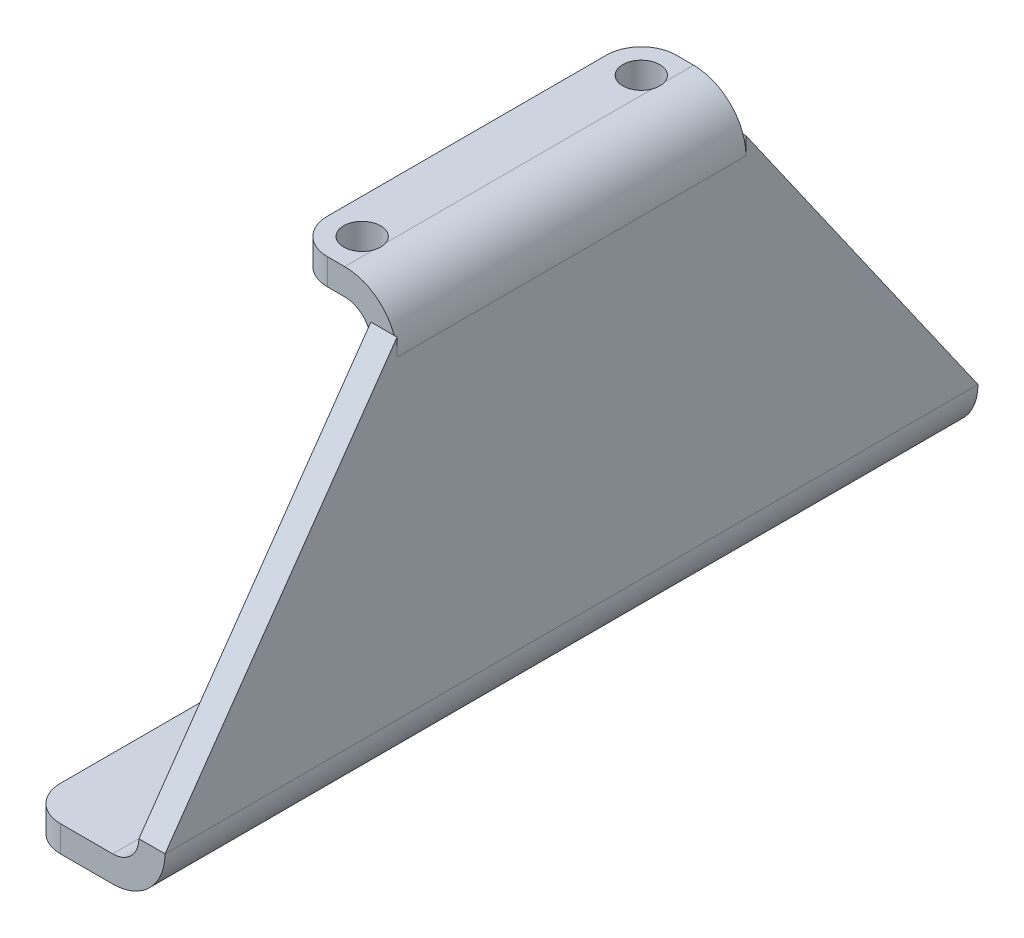
ISO-10303-21;
HEADER;
FILE_DESCRIPTION(('STEP AP214'),'2;1');
FILE_NAME('part.step','',(''),(''),'','','');
FILE_SCHEMA(('AUTOMOTIVE_DESIGN { 1 0 10303 214 1 1 1 1 }'));
ENDSEC;
DATA;
#1=APPLICATION_CONTEXT('core data for automotive mechanical design processes');
#2=APPLICATION_PROTOCOL_DEFINITION('international standard','automotive_design',2000,#1);
#3=PRODUCT_CONTEXT('',#1,'mechanical');
#4=PRODUCT('Part','Part','',(#3));
#5=PRODUCT_RELATED_PRODUCT_CATEGORY('part','',(#4));
#6=PRODUCT_DEFINITION_FORMATION('','',#4);
#7=PRODUCT_DEFINITION_CONTEXT('part definition',#1,'design');
#8=PRODUCT_DEFINITION('design','',#6,#7);
#9=PRODUCT_DEFINITION_SHAPE('','',#8);
#10=(LENGTH_UNIT() NAMED_UNIT(*) SI_UNIT(.MILLI.,.METRE.));
#11=(NAMED_UNIT(*) PLANE_ANGLE_UNIT() SI_UNIT($,.RADIAN.));
#12=(NAMED_UNIT(*) SI_UNIT($,.STERADIAN.) SOLID_ANGLE_UNIT());
#13=UNCERTAINTY_MEASURE_WITH_UNIT(LENGTH_MEASURE(1.E-05),#10,'distance_accuracy_value','');
#14=(GEOMETRIC_REPRESENTATION_CONTEXT(3) GLOBAL_UNCERTAINTY_ASSIGNED_CONTEXT((#13)) GLOBAL_UNIT_ASSIGNED_CONTEXT((#10,
#11,#12)) REPRESENTATION_CONTEXT('',''));
#15=CARTESIAN_POINT('',(0.,0.,0.));
#16=DIRECTION('',(0.,0.,1.));
#17=DIRECTION('',(1.,0.,0.));
#18=AXIS2_PLACEMENT_3D('',#15,#16,#17);
#19=CARTESIAN_POINT('',(0.424159087981626,71.58740588383,-31.75));
#20=DIRECTION('',(0.,0.,1.));
#21=DIRECTION('',(1.,0.,0.));
#22=AXIS2_PLACEMENT_3D('',#19,#20,#21);
#23=PLANE('',#22);
#24=CARTESIAN_POINT('',(-4.7625,66.675,-31.75));
#25=DIRECTION('',(0.,0.,-1.));
#26=DIRECTION('',(-1.,0.,0.));
#27=AXIS2_PLACEMENT_3D('',#24,#25,#26);
#28=CIRCLE('',#27,4.7625);
#29=CARTESIAN_POINT('',(0.,66.675,-31.749999875));
#30=VERTEX_POINT('',#29);
#31=CARTESIAN_POINT('',(-4.7625,71.4375,-31.75));
#32=VERTEX_POINT('',#31);
#33=EDGE_CURVE('E162',#30,#32,#28,.F.);
#34=ORIENTED_EDGE('',*,*,#33,.T.);
#35=DIRECTION('',(1.,0.,0.));
#36=VECTOR('',#35,1.);
#37=CARTESIAN_POINT('',(-4.7625,71.4375,-31.75));
#38=LINE('',#37,#36);
#39=CARTESIAN_POINT('',(-7.9375,71.4375,-31.75));
#40=VERTEX_POINT('',#39);
#41=EDGE_CURVE('E164',#40,#32,#38,.T.);
#42=ORIENTED_EDGE('',*,*,#41,.F.);
#43=DIRECTION('',(0.,1.,0.));
#44=VECTOR('',#43,1.);
#45=CARTESIAN_POINT('',(-7.9375,73.81875,-31.75));
#46=LINE('',#45,#44);
#47=CARTESIAN_POINT('',(-7.9375,76.2,-31.75));
#48=VERTEX_POINT('',#47);
#49=EDGE_CURVE('E181',#48,#40,#46,.F.);
#50=ORIENTED_EDGE('',*,*,#49,.F.);
#51=DIRECTION('',(1.,0.,0.));
#52=VECTOR('',#51,1.);
#53=CARTESIAN_POINT('',(-9.525,76.2,-31.75));
#54=LINE('',#53,#52);
#55=CARTESIAN_POINT('',(-4.7625,76.2,-31.75));
#56=VERTEX_POINT('',#55);
#57=EDGE_CURVE('E341',#56,#48,#54,.F.);
#58=ORIENTED_EDGE('',*,*,#57,.F.);
#59=CARTESIAN_POINT('',(-4.7625,66.675,-31.75));
#60=DIRECTION('',(0.,0.,-1.));
#61=DIRECTION('',(-1.,0.,0.));
#62=AXIS2_PLACEMENT_3D('',#59,#60,#61);
#63=CIRCLE('',#62,9.525);
#64=CARTESIAN_POINT('',(4.762499875,66.675,-31.75));
#65=VERTEX_POINT('',#64);
#66=EDGE_CURVE('E554',#56,#65,#63,.T.);
#67=ORIENTED_EDGE('',*,*,#66,.T.);
#68=CARTESIAN_POINT('',(0.,66.675,-31.75));
#69=CARTESIAN_POINT('',(4.7625,66.675,-31.75));
#70=B_SPLINE_CURVE_WITH_KNOTS('',1,(#68,#69),.UNSPECIFIED.,.F.,.F.,(2,2),(0.,1.),.UNSPECIFIED.);
#71=EDGE_CURVE('E168',#30,#65,#70,.T.);
#72=ORIENTED_EDGE('',*,*,#71,.F.);
#73=EDGE_LOOP('',(#34,#42,#50,#58,#67,#72));
#74=FACE_BOUND('',#73,.T.);
#75=ADVANCED_FACE('F16',(#74),#23,.F.);
#76=CARTESIAN_POINT('',(-4.7625,66.675,31.75));
#77=DIRECTION('',(0.,0.,-1.));
#78=DIRECTION('',(-1.,0.,0.));
#79=AXIS2_PLACEMENT_3D('',#76,#77,#78);
#80=CYLINDRICAL_SURFACE('',#79,4.7625);
#81=DIRECTION('',(0.,0.,-1.));
#82=VECTOR('',#81,1.);
#83=CARTESIAN_POINT('',(-4.7625,71.4375,31.75));
#84=LINE('',#83,#82);
#85=CARTESIAN_POINT('',(-4.76249999999993,71.4375,-24.283771864716));
#86=VERTEX_POINT('',#85);
#87=CARTESIAN_POINT('',(-4.76249999999993,71.4375,24.283771864716));
#88=VERTEX_POINT('',#87);
#89=EDGE_CURVE('E190',#86,#88,#84,.F.);
#90=ORIENTED_EDGE('',*,*,#89,.F.);
#91=CARTESIAN_POINT('',(-4.76249999999986,71.4375,-24.2837718647162));
#92=CARTESIAN_POINT('',(-4.73059783371405,71.437480197096,-24.3744813629804));
#93=CARTESIAN_POINT('',(-4.70260402884335,71.4371785023755,-24.4665633628558));
#94=CARTESIAN_POINT('',(-4.65459400696457,71.4363432994934,-24.6527764815958));
#95=CARTESIAN_POINT('',(-4.6345772241837,71.4358098077777,-24.7469074546366));
#96=CARTESIAN_POINT('',(-4.60311975406902,71.434856288217,-24.9339069525274));
#97=CARTESIAN_POINT('',(-4.5914566788182,71.4344335246449,-25.0267381214644));
#98=CARTESIAN_POINT('',(-4.57589698218412,71.4338496240032,-25.2130462137356));
#99=CARTESIAN_POINT('',(-4.572,71.4336884747796,-25.3065231068678));
#100=CARTESIAN_POINT('',(-4.572,71.4336884747796,-25.493476893132));
#101=CARTESIAN_POINT('',(-4.5758969821841,71.4338496240032,-25.586953786264));
#102=CARTESIAN_POINT('',(-4.59145667881812,71.4344335246449,-25.7732618785348));
#103=CARTESIAN_POINT('',(-4.60311975406889,71.434856288217,-25.8660930474716));
#104=CARTESIAN_POINT('',(-4.63457722418344,71.4358098077777,-26.053092545362));
#105=CARTESIAN_POINT('',(-4.65459400696422,71.4363432994934,-26.1472235184027));
#106=CARTESIAN_POINT('',(-4.7026040288428,71.4371785023755,-26.3334366371423));
#107=CARTESIAN_POINT('',(-4.73059783371339,71.437480197096,-26.4255186370175));
#108=CARTESIAN_POINT('',(-4.76249999999907,71.4375,-26.5162281352815));
#109=B_SPLINE_CURVE_WITH_KNOTS('',3,(#91,#92,#93,#94,#95,#96,#97,#98,#99,#100,#101,#102,#103,
#104,#105,#106,#107,#108),.UNSPECIFIED.,.F.,.F.,(4,2,2,2,2,2,2,2,4),(0.,0.288377572680512,
0.576734688449527,0.857097022705416,1.13744633145026,1.41779564019452,1.69815797444983,
1.98651509021823,2.27489266289813),.UNSPECIFIED.);
#110=CARTESIAN_POINT('',(-4.76249999999953,71.4375,-26.5162281352829));
#111=VERTEX_POINT('',#110);
#112=EDGE_CURVE('E185',#86,#111,#109,.T.);
#113=ORIENTED_EDGE('',*,*,#112,.T.);
#114=DIRECTION('',(0.,0.,-1.));
#115=VECTOR('',#114,1.);
#116=CARTESIAN_POINT('',(-4.7625,71.4375,31.75));
#117=LINE('',#116,#115);
#118=EDGE_CURVE('E177',#32,#111,#117,.F.);
#119=ORIENTED_EDGE('',*,*,#118,.F.);
#120=ORIENTED_EDGE('',*,*,#33,.F.);
#121=CARTESIAN_POINT('',(0.,66.675,31.75));
#122=CARTESIAN_POINT('',(0.,66.675,-31.75));
#123=B_SPLINE_CURVE_WITH_KNOTS('',1,(#121,#122),.UNSPECIFIED.,.F.,.F.,(2,2),(0.,1.),.UNSPECIFIED.);
#124=CARTESIAN_POINT('',(0.,66.6750000625,31.75));
#125=VERTEX_POINT('',#124);
#126=EDGE_CURVE('E186',#125,#30,#123,.T.);
#127=ORIENTED_EDGE('',*,*,#126,.F.);
#128=CARTESIAN_POINT('',(-4.7625,66.675,31.75));
#129=DIRECTION('',(0.,0.,-1.));
#130=DIRECTION('',(-1.,0.,0.));
#131=AXIS2_PLACEMENT_3D('',#128,#129,#130);
#132=CIRCLE('',#131,4.7625);
#133=CARTESIAN_POINT('',(-4.7625,71.4375,31.75));
#134=VERTEX_POINT('',#133);
#135=EDGE_CURVE('E188',#134,#125,#132,.T.);
#136=ORIENTED_EDGE('',*,*,#135,.F.);
#137=DIRECTION('',(0.,0.,-1.));
#138=VECTOR('',#137,1.);
#139=CARTESIAN_POINT('',(-4.7625,71.4375,31.75));
#140=LINE('',#139,#138);
#141=CARTESIAN_POINT('',(-4.76249999999953,71.4375,26.5162281352829));
#142=VERTEX_POINT('',#141);
#143=EDGE_CURVE('E208',#142,#134,#140,.F.);
#144=ORIENTED_EDGE('',*,*,#143,.F.);
#145=CARTESIAN_POINT('',(-4.76249999999907,71.4375,26.5162281352815));
#146=CARTESIAN_POINT('',(-4.73059783371339,71.437480197096,26.4255186370176));
#147=CARTESIAN_POINT('',(-4.7026040288428,71.4371785023755,26.3334366371423));
#148=CARTESIAN_POINT('',(-4.65459400696423,71.4363432994934,26.1472235184027));
#149=CARTESIAN_POINT('',(-4.63457722418344,71.4358098077777,26.053092545362));
#150=CARTESIAN_POINT('',(-4.60311975406889,71.434856288217,25.8660930474717));
#151=CARTESIAN_POINT('',(-4.59145667881812,71.4344335246449,25.7732618785348));
#152=CARTESIAN_POINT('',(-4.5758969821841,71.4338496240032,25.586953786264));
#153=CARTESIAN_POINT('',(-4.572,71.4336884747796,25.493476893132));
#154=CARTESIAN_POINT('',(-4.572,71.4336884747796,25.3065231068678));
#155=CARTESIAN_POINT('',(-4.57589698218412,71.4338496240032,25.2130462137356));
#156=CARTESIAN_POINT('',(-4.5914566788182,71.4344335246449,25.0267381214644));
#157=CARTESIAN_POINT('',(-4.60311975406902,71.434856288217,24.9339069525274));
#158=CARTESIAN_POINT('',(-4.6345772241837,71.4358098077777,24.7469074546366));
#159=CARTESIAN_POINT('',(-4.65459400696457,71.4363432994934,24.6527764815958));
#160=CARTESIAN_POINT('',(-4.70260402884335,71.4371785023755,24.4665633628558));
#161=CARTESIAN_POINT('',(-4.73059783371405,71.437480197096,24.3744813629804));
#162=CARTESIAN_POINT('',(-4.76249999999986,71.4375,24.2837718647162));
#163=B_SPLINE_CURVE_WITH_KNOTS('',3,(#145,#146,#147,#148,#149,#150,#151,#152,#153,#154,#155,
#156,#157,#158,#159,#160,#161,#162),.UNSPECIFIED.,.F.,.F.,(4,2,2,2,2,2,2,2,4),(0.,
0.288377572679895,0.576734688448295,0.857097022703605,1.13744633144787,1.41779564019271,
1.6981579744486,1.98651509021762,2.27489266289813),.UNSPECIFIED.);
#164=EDGE_CURVE('E213',#142,#88,#163,.T.);
#165=ORIENTED_EDGE('',*,*,#164,.T.);
#166=EDGE_LOOP('',(#90,#113,#119,#120,#127,#136,#144,#165));
#167=FACE_BOUND('',#166,.T.);
#168=ADVANCED_FACE('F183',(#167),#80,.F.);
#169=CARTESIAN_POINT('',(0.,0.,0.));
#170=DIRECTION('',(1.,0.,0.));
#171=DIRECTION('',(0.,0.,-1.));
#172=AXIS2_PLACEMENT_3D('',#169,#170,#171);
#173=PLANE('',#172);
#174=CARTESIAN_POINT('',(0.,66.675,31.75));
#175=CARTESIAN_POINT('',(0.,69.85,31.75));
#176=B_SPLINE_CURVE_WITH_KNOTS('',1,(#174,#175),.UNSPECIFIED.,.F.,.F.,(2,2),(0.,1.),.UNSPECIFIED.);
#177=CARTESIAN_POINT('',(0.,69.85,31.75));
#178=VERTEX_POINT('',#177);
#179=EDGE_CURVE('E220',#125,#178,#176,.T.);
#180=ORIENTED_EDGE('',*,*,#179,.F.);
#181=ORIENTED_EDGE('',*,*,#126,.T.);
#182=CARTESIAN_POINT('',(0.,66.675,-31.75));
#183=CARTESIAN_POINT('',(0.,69.85,-31.75));
#184=B_SPLINE_CURVE_WITH_KNOTS('',1,(#182,#183),.UNSPECIFIED.,.F.,.F.,(2,2),(0.,1.),.UNSPECIFIED.);
#185=CARTESIAN_POINT('',(0.,69.8499998333333,-31.75));
#186=VERTEX_POINT('',#185);
#187=EDGE_CURVE('E34',#30,#186,#184,.T.);
#188=ORIENTED_EDGE('',*,*,#187,.T.);
#189=CARTESIAN_POINT('',(0.,9.525,-73.9775));
#190=CARTESIAN_POINT('',(0.,69.85,-31.75));
#191=B_SPLINE_CURVE_WITH_KNOTS('',1,(#189,#190),.UNSPECIFIED.,.F.,.F.,(2,2),(0.,1.),.UNSPECIFIED.);
#192=CARTESIAN_POINT('',(0.,9.525,-73.9775));
#193=VERTEX_POINT('',#192);
#194=EDGE_CURVE('E443',#193,#186,#191,.T.);
#195=ORIENTED_EDGE('',*,*,#194,.F.);
#196=CARTESIAN_POINT('',(0.,9.525,73.9775));
#197=CARTESIAN_POINT('',(0.,9.525,-73.9775));
#198=B_SPLINE_CURVE_WITH_KNOTS('',1,(#196,#197),.UNSPECIFIED.,.F.,.F.,(2,2),(0.,1.),.UNSPECIFIED.);
#199=CARTESIAN_POINT('',(0.,9.52500012500001,73.9774999125));
#200=VERTEX_POINT('',#199);
#201=EDGE_CURVE('E433',#200,#193,#198,.T.);
#202=ORIENTED_EDGE('',*,*,#201,.F.);
#203=CARTESIAN_POINT('',(0.,69.85,31.75));
#204=CARTESIAN_POINT('',(0.,9.52500000000005,73.9775));
#205=B_SPLINE_CURVE_WITH_KNOTS('',1,(#203,#204),.UNSPECIFIED.,.F.,.F.,(2,2),(0.,1.),.UNSPECIFIED.);
#206=EDGE_CURVE('E427',#178,#200,#205,.T.);
#207=ORIENTED_EDGE('',*,*,#206,.F.);
#208=EDGE_LOOP('',(#180,#181,#188,#195,#202,#207));
#209=FACE_BOUND('',#208,.T.);
#210=ADVANCED_FACE('F303',(#209),#173,.F.);
#211=CARTESIAN_POINT('',(4.7625,0.,0.));
#212=DIRECTION('',(1.,0.,0.));
#213=DIRECTION('',(0.,0.,-1.));
#214=AXIS2_PLACEMENT_3D('',#211,#212,#213);
#215=PLANE('',#214);
#216=DIRECTION('',(0.,0.,-1.));
#217=VECTOR('',#216,1.);
#218=CARTESIAN_POINT('',(4.7625,66.675,31.75));
#219=LINE('',#218,#217);
#220=CARTESIAN_POINT('',(4.76249975,66.675,31.75));
#221=VERTEX_POINT('',#220);
#222=EDGE_CURVE('E422',#221,#65,#219,.T.);
#223=ORIENTED_EDGE('',*,*,#222,.F.);
#224=CARTESIAN_POINT('',(4.7625,66.675,31.75));
#225=CARTESIAN_POINT('',(4.7625,69.85,31.75));
#226=B_SPLINE_CURVE_WITH_KNOTS('',1,(#224,#225),.UNSPECIFIED.,.F.,.F.,(2,2),(0.,1.),.UNSPECIFIED.);
#227=CARTESIAN_POINT('',(4.76249983333333,69.85,31.75));
#228=VERTEX_POINT('',#227);
#229=EDGE_CURVE('E413',#221,#228,#226,.T.);
#230=ORIENTED_EDGE('',*,*,#229,.T.);
#231=DIRECTION('',(0.,0.81923192051904,-0.573462344363328));
#232=VECTOR('',#231,1.);
#233=CARTESIAN_POINT('',(4.7625,38.1,53.975));
#234=LINE('',#233,#232);
#235=CARTESIAN_POINT('',(4.7625,9.52499999999999,73.9775));
#236=VERTEX_POINT('',#235);
#237=EDGE_CURVE('E409',#228,#236,#234,.F.);
#238=ORIENTED_EDGE('',*,*,#237,.T.);
#239=DIRECTION('',(0.,0.,-1.));
#240=VECTOR('',#239,1.);
#241=CARTESIAN_POINT('',(4.7625,9.525,0.));
#242=LINE('',#241,#240);
#243=CARTESIAN_POINT('',(4.7625,9.52499999999999,-73.9775));
#244=VERTEX_POINT('',#243);
#245=EDGE_CURVE('E407',#236,#244,#242,.T.);
#246=ORIENTED_EDGE('',*,*,#245,.T.);
#247=DIRECTION('',(0.,-0.81923192051904,-0.573462344363328));
#248=VECTOR('',#247,1.);
#249=CARTESIAN_POINT('',(4.7625,38.1,-53.975));
#250=LINE('',#249,#248);
#251=CARTESIAN_POINT('',(4.7625,69.8499998333333,-31.75));
#252=VERTEX_POINT('',#251);
#253=EDGE_CURVE('E406',#244,#252,#250,.F.);
#254=ORIENTED_EDGE('',*,*,#253,.T.);
#255=CARTESIAN_POINT('',(4.7625,66.675,-31.75));
#256=CARTESIAN_POINT('',(4.7625,69.85,-31.75));
#257=B_SPLINE_CURVE_WITH_KNOTS('',1,(#255,#256),.UNSPECIFIED.,.F.,.F.,(2,2),(0.,1.),.UNSPECIFIED.);
#258=EDGE_CURVE('E26',#65,#252,#257,.T.);
#259=ORIENTED_EDGE('',*,*,#258,.F.);
#260=EDGE_LOOP('',(#223,#230,#238,#246,#254,#259));
#261=FACE_BOUND('',#260,.T.);
#262=ADVANCED_FACE('F307',(#261),#215,.T.);
#263=CARTESIAN_POINT('',(2.38125,38.1,-53.975));
#264=DIRECTION('',(0.,-0.573462344363328,0.81923192051904));
#265=DIRECTION('',(0.,-0.81923192051904,-0.573462344363328));
#266=AXIS2_PLACEMENT_3D('',#263,#264,#265);
#267=PLANE('',#266);
#268=CARTESIAN_POINT('',(0.,69.85,-31.75));
#269=CARTESIAN_POINT('',(4.7625,69.85,-31.75));
#270=B_SPLINE_CURVE_WITH_KNOTS('',1,(#268,#269),.UNSPECIFIED.,.F.,.F.,(2,2),(0.,1.),.UNSPECIFIED.);
#271=EDGE_CURVE('E10',#186,#252,#270,.T.);
#272=ORIENTED_EDGE('',*,*,#271,.T.);
#273=ORIENTED_EDGE('',*,*,#253,.F.);
#274=DIRECTION('',(1.,0.,0.));
#275=VECTOR('',#274,1.);
#276=CARTESIAN_POINT('',(2.38125,9.52499999999999,-73.9775));
#277=LINE('',#276,#275);
#278=EDGE_CURVE('E401',#193,#244,#277,.T.);
#279=ORIENTED_EDGE('',*,*,#278,.F.);
#280=ORIENTED_EDGE('',*,*,#194,.T.);
#281=EDGE_LOOP('',(#272,#273,#279,#280));
#282=FACE_BOUND('',#281,.T.);
#283=ADVANCED_FACE('F311',(#282),#267,.F.);
#284=CARTESIAN_POINT('',(-4.7625,71.4375,31.75));
#285=DIRECTION('',(0.,-1.,0.));
#286=DIRECTION('',(0.,0.,-1.));
#287=AXIS2_PLACEMENT_3D('',#284,#285,#286);
#288=PLANE('',#287);
#289=ORIENTED_EDGE('',*,*,#89,.T.);
#290=CARTESIAN_POINT('',(-7.9375,71.4375,25.4));
#291=DIRECTION('',(0.,-1.,0.));
#292=DIRECTION('',(0.,0.,-1.));
#293=AXIS2_PLACEMENT_3D('',#290,#291,#292);
#294=CIRCLE('',#293,3.3655);
#295=EDGE_CURVE('E398',#88,#142,#294,.F.);
#296=ORIENTED_EDGE('',*,*,#295,.T.);
#297=ORIENTED_EDGE('',*,*,#143,.T.);
#298=CARTESIAN_POINT('',(-7.9375,71.4375,31.75));
#299=CARTESIAN_POINT('',(-4.7625,71.4375,31.75));
#300=B_SPLINE_CURVE_WITH_KNOTS('',1,(#298,#299),.UNSPECIFIED.,.F.,.F.,(2,2),(0.,1.),.UNSPECIFIED.);
#301=CARTESIAN_POINT('',(-7.9375,71.4375,31.75));
#302=VERTEX_POINT('',#301);
#303=EDGE_CURVE('E388',#302,#134,#300,.T.);
#304=ORIENTED_EDGE('',*,*,#303,.F.);
#305=CARTESIAN_POINT('',(-7.9375,71.4375,25.4));
#306=DIRECTION('',(0.,1.,0.));
#307=DIRECTION('',(0.,0.,1.));
#308=AXIS2_PLACEMENT_3D('',#305,#306,#307);
#309=CIRCLE('',#308,6.35);
#310=CARTESIAN_POINT('',(-14.2875,71.4375,25.4));
#311=VERTEX_POINT('',#310);
#312=EDGE_CURVE('E384',#302,#311,#309,.F.);
#313=ORIENTED_EDGE('',*,*,#312,.T.);
#314=DIRECTION('',(0.,0.,-1.));
#315=VECTOR('',#314,1.);
#316=CARTESIAN_POINT('',(-14.2875,71.4375,31.75));
#317=LINE('',#316,#315);
#318=CARTESIAN_POINT('',(-14.2875,71.4375,-25.4));
#319=VERTEX_POINT('',#318);
#320=EDGE_CURVE('E382',#311,#319,#317,.T.);
#321=ORIENTED_EDGE('',*,*,#320,.T.);
#322=CARTESIAN_POINT('',(-7.9375,71.4375,-25.4));
#323=DIRECTION('',(0.,1.,0.));
#324=DIRECTION('',(0.,0.,1.));
#325=AXIS2_PLACEMENT_3D('',#322,#323,#324);
#326=CIRCLE('',#325,6.35);
#327=EDGE_CURVE('E180',#319,#40,#326,.F.);
#328=ORIENTED_EDGE('',*,*,#327,.T.);
#329=ORIENTED_EDGE('',*,*,#41,.T.);
#330=ORIENTED_EDGE('',*,*,#118,.T.);
#331=CARTESIAN_POINT('',(-7.9375,71.4375,-25.4));
#332=DIRECTION('',(0.,-1.,0.));
#333=DIRECTION('',(0.,0.,-1.));
#334=AXIS2_PLACEMENT_3D('',#331,#332,#333);
#335=CIRCLE('',#334,3.3655);
#336=EDGE_CURVE('E335',#111,#86,#335,.F.);
#337=ORIENTED_EDGE('',*,*,#336,.T.);
#338=EDGE_LOOP('',(#289,#296,#297,#304,#313,#321,#328,#329,#330,#337));
#339=FACE_BOUND('',#338,.T.);
#340=ADVANCED_FACE('F175',(#339),#288,.T.);
#341=CARTESIAN_POINT('',(-7.9375,-99.3525934145834,-25.4));
#342=DIRECTION('',(0.,1.,0.));
#343=DIRECTION('',(0.,0.,1.));
#344=AXIS2_PLACEMENT_3D('',#341,#342,#343);
#345=CYLINDRICAL_SURFACE('',#344,6.35);
#346=DIRECTION('',(0.,1.,0.));
#347=VECTOR('',#346,1.);
#348=CARTESIAN_POINT('',(-14.2875,-99.3525934145834,-25.4));
#349=LINE('',#348,#347);
#350=CARTESIAN_POINT('',(-14.2875,76.2,-25.4));
#351=VERTEX_POINT('',#350);
#352=EDGE_CURVE('E329',#319,#351,#349,.T.);
#353=ORIENTED_EDGE('',*,*,#352,.T.);
#354=CARTESIAN_POINT('',(-7.9375,76.2,-25.4));
#355=DIRECTION('',(0.,1.,0.));
#356=DIRECTION('',(0.,0.,1.));
#357=AXIS2_PLACEMENT_3D('',#354,#355,#356);
#358=CIRCLE('',#357,6.35);
#359=EDGE_CURVE('E331',#351,#48,#358,.F.);
#360=ORIENTED_EDGE('',*,*,#359,.T.);
#361=ORIENTED_EDGE('',*,*,#49,.T.);
#362=ORIENTED_EDGE('',*,*,#327,.F.);
#363=EDGE_LOOP('',(#353,#360,#361,#362));
#364=FACE_BOUND('',#363,.T.);
#365=ADVANCED_FACE('F320',(#364),#345,.T.);
#366=CARTESIAN_POINT('',(-4.7625,76.2,31.75));
#367=DIRECTION('',(0.,-1.,0.));
#368=DIRECTION('',(0.,0.,-1.));
#369=AXIS2_PLACEMENT_3D('',#366,#367,#368);
#370=PLANE('',#369);
#371=DIRECTION('',(0.,0.,-1.));
#372=VECTOR('',#371,1.);
#373=CARTESIAN_POINT('',(-4.7625,76.2,31.75));
#374=LINE('',#373,#372);
#375=CARTESIAN_POINT('',(-4.76249999999995,76.2,24.283771864716));
#376=VERTEX_POINT('',#375);
#377=CARTESIAN_POINT('',(-4.76249999999996,76.2,-24.2837718647159));
#378=VERTEX_POINT('',#377);
#379=EDGE_CURVE('E342',#376,#378,#374,.T.);
#380=ORIENTED_EDGE('',*,*,#379,.T.);
#381=CARTESIAN_POINT('',(-7.9375,76.2,-25.4));
#382=DIRECTION('',(0.,-1.,0.));
#383=DIRECTION('',(0.,0.,-1.));
#384=AXIS2_PLACEMENT_3D('',#381,#382,#383);
#385=CIRCLE('',#384,3.3655);
#386=CARTESIAN_POINT('',(-4.76249999999968,76.2,-26.5162281352833));
#387=VERTEX_POINT('',#386);
#388=EDGE_CURVE('E353',#378,#387,#385,.T.);
#389=ORIENTED_EDGE('',*,*,#388,.T.);
#390=DIRECTION('',(0.,0.,-1.));
#391=VECTOR('',#390,1.);
#392=CARTESIAN_POINT('',(-4.7625,76.2,31.75));
#393=LINE('',#392,#391);
#394=EDGE_CURVE('E349',#387,#56,#393,.T.);
#395=ORIENTED_EDGE('',*,*,#394,.T.);
#396=ORIENTED_EDGE('',*,*,#57,.T.);
#397=ORIENTED_EDGE('',*,*,#359,.F.);
#398=DIRECTION('',(0.,0.,-1.));
#399=VECTOR('',#398,1.);
#400=CARTESIAN_POINT('',(-14.2875,76.2,0.));
#401=LINE('',#400,#399);
#402=CARTESIAN_POINT('',(-14.2875,76.2,25.4));
#403=VERTEX_POINT('',#402);
#404=EDGE_CURVE('E338',#351,#403,#401,.F.);
#405=ORIENTED_EDGE('',*,*,#404,.T.);
#406=CARTESIAN_POINT('',(-7.9375,76.2,25.4));
#407=DIRECTION('',(0.,1.,0.));
#408=DIRECTION('',(0.,0.,1.));
#409=AXIS2_PLACEMENT_3D('',#406,#407,#408);
#410=CIRCLE('',#409,6.35);
#411=CARTESIAN_POINT('',(-7.93749983333333,76.2,31.75));
#412=VERTEX_POINT('',#411);
#413=EDGE_CURVE('E348',#412,#403,#410,.F.);
#414=ORIENTED_EDGE('',*,*,#413,.F.);
#415=CARTESIAN_POINT('',(-4.7625,76.2,31.75));
#416=CARTESIAN_POINT('',(-7.9375,76.2,31.75));
#417=B_SPLINE_CURVE_WITH_KNOTS('',1,(#415,#416),.UNSPECIFIED.,.F.,.F.,(2,2),(0.,1.),.UNSPECIFIED.);
#418=CARTESIAN_POINT('',(-4.7625,76.2,31.75));
#419=VERTEX_POINT('',#418);
#420=EDGE_CURVE('E351',#419,#412,#417,.T.);
#421=ORIENTED_EDGE('',*,*,#420,.F.);
#422=DIRECTION('',(0.,0.,-1.));
#423=VECTOR('',#422,1.);
#424=CARTESIAN_POINT('',(-4.7625,76.2,31.75));
#425=LINE('',#424,#423);
#426=CARTESIAN_POINT('',(-4.76249999999977,76.2,26.5162281352835));
#427=VERTEX_POINT('',#426);
#428=EDGE_CURVE('E361',#419,#427,#425,.T.);
#429=ORIENTED_EDGE('',*,*,#428,.T.);
#430=CARTESIAN_POINT('',(-7.9375,76.2,25.4));
#431=DIRECTION('',(0.,-1.,0.));
#432=DIRECTION('',(0.,0.,-1.));
#433=AXIS2_PLACEMENT_3D('',#430,#431,#432);
#434=CIRCLE('',#433,3.3655);
#435=EDGE_CURVE('E369',#427,#376,#434,.T.);
#436=ORIENTED_EDGE('',*,*,#435,.T.);
#437=EDGE_LOOP('',(#380,#389,#395,#396,#397,#405,#414,#421,#429,#436));
#438=FACE_BOUND('',#437,.T.);
#439=ADVANCED_FACE('F257',(#438),#370,.F.);
#440=CARTESIAN_POINT('',(-4.7625,66.675,31.75));
#441=DIRECTION('',(0.,0.,-1.));
#442=DIRECTION('',(-1.,0.,0.));
#443=AXIS2_PLACEMENT_3D('',#440,#441,#442);
#444=CYLINDRICAL_SURFACE('',#443,9.525);
#445=ORIENTED_EDGE('',*,*,#66,.F.);
#446=ORIENTED_EDGE('',*,*,#394,.F.);
#447=CARTESIAN_POINT('',(-4.76249999999937,76.2,-26.5162281352824));
#448=CARTESIAN_POINT('',(-4.73066640683086,76.1999901734564,-26.425713583084));
#449=CARTESIAN_POINT('',(-4.70272414462855,76.1998399353362,-26.3338316346276));
#450=CARTESIAN_POINT('',(-4.65478279520521,76.1994237271423,-26.1480260329157));
#451=CARTESIAN_POINT('',(-4.63478308168491,76.1991577661972,-26.0541025412596));
#452=CARTESIAN_POINT('',(-4.60332342751014,76.198681824027,-25.8675090327244));
#453=CARTESIAN_POINT('',(-4.59164259294069,76.1984704979659,-25.7748761953977));
#454=CARTESIAN_POINT('',(-4.57601471639067,76.1981776639248,-25.588963347429));
#455=CARTESIAN_POINT('',(-4.57206737785366,76.1980961509668,-25.4956833617409));
#456=CARTESIAN_POINT('',(-4.57193405729563,76.1980934966919,-25.3087291359371));
#457=CARTESIAN_POINT('',(-4.57578045346321,76.1981730243993,-25.2150548710986));
#458=CARTESIAN_POINT('',(-4.59127180817006,76.198463776309,-25.0283499982213));
#459=CARTESIAN_POINT('',(-4.60291712205758,76.1986750065121,-24.9353194197063));
#460=CARTESIAN_POINT('',(-4.63437253187716,76.1991522634313,-24.7479132801496));
#461=CARTESIAN_POINT('',(-4.65440634101935,76.1994196829879,-24.6535752026542));
#462=CARTESIAN_POINT('',(-4.70248473114054,76.199838554472,-24.4669555336056));
#463=CARTESIAN_POINT('',(-4.73052990352598,76.199989997835,-24.3746740944179));
#464=CARTESIAN_POINT('',(-4.76249999809491,76.2,-24.2837718701347));
#465=B_SPLINE_CURVE_WITH_KNOTS('',3,(#447,#448,#449,#450,#451,#452,#453,#454,#455,#456,#457,
#458,#459,#460,#461,#462,#463,#464),.UNSPECIFIED.,.F.,.F.,(4,2,2,2,2,2,2,2,4),(0.,
0.287759444438045,0.575496193474332,0.855274721163098,1.13504251997253,1.41597496527226,
1.69692021178992,1.98589022143224,2.2748815686309),.UNSPECIFIED.);
#466=EDGE_CURVE('E245',#387,#378,#465,.T.);
#467=ORIENTED_EDGE('',*,*,#466,.T.);
#468=ORIENTED_EDGE('',*,*,#379,.F.);
#469=CARTESIAN_POINT('',(-4.76249999999991,76.2,24.2837718647161));
#470=CARTESIAN_POINT('',(-4.73066640683136,76.1999901734564,24.3742864169145));
#471=CARTESIAN_POINT('',(-4.702724144629,76.1998399353362,24.4661683653708));
#472=CARTESIAN_POINT('',(-4.65478279520557,76.1994237271423,24.6519739670827));
#473=CARTESIAN_POINT('',(-4.63478308168522,76.1991577661972,24.7458974587388));
#474=CARTESIAN_POINT('',(-4.60332342751036,76.198681824027,24.9324909672739));
#475=CARTESIAN_POINT('',(-4.59164259294087,76.1984704979659,25.0251238046007));
#476=CARTESIAN_POINT('',(-4.57601471639076,76.1981776639248,25.2110366525694));
#477=CARTESIAN_POINT('',(-4.5720673778537,76.1980961509668,25.3043166382575));
#478=CARTESIAN_POINT('',(-4.57193405729559,76.1980934966919,25.4912708640613));
#479=CARTESIAN_POINT('',(-4.57578045346312,76.1981730243993,25.5849451288998));
#480=CARTESIAN_POINT('',(-4.59127180816988,76.198463776309,25.7716500017771));
#481=CARTESIAN_POINT('',(-4.60291712205735,76.1986750065121,25.8646805802921));
#482=CARTESIAN_POINT('',(-4.63437253187685,76.1991522634313,26.0520867198488));
#483=CARTESIAN_POINT('',(-4.654406341019,76.1994196829879,26.1464247973442));
#484=CARTESIAN_POINT('',(-4.70248473114009,76.199838554472,26.3330444663928));
#485=CARTESIAN_POINT('',(-4.73052990352549,76.199989997835,26.4253259055806));
#486=CARTESIAN_POINT('',(-4.76249999809437,76.2,26.5162281298638));
#487=B_SPLINE_CURVE_WITH_KNOTS('',3,(#469,#470,#471,#472,#473,#474,#475,#476,#477,#478,#479,
#480,#481,#482,#483,#484,#485,#486),.UNSPECIFIED.,.F.,.F.,(4,2,2,2,2,2,2,2,4),(0.,
0.287759444438044,0.575496193474332,0.855274721163097,1.13504251997253,1.41597496527226,
1.69692021178992,1.98589022143223,2.2748815686309),.UNSPECIFIED.);
#488=EDGE_CURVE('E236',#376,#427,#487,.T.);
#489=ORIENTED_EDGE('',*,*,#488,.T.);
#490=ORIENTED_EDGE('',*,*,#428,.F.);
#491=CARTESIAN_POINT('',(-4.7625,66.675,31.75));
#492=DIRECTION('',(0.,0.,-1.));
#493=DIRECTION('',(-1.,0.,0.));
#494=AXIS2_PLACEMENT_3D('',#491,#492,#493);
#495=CIRCLE('',#494,9.525);
#496=EDGE_CURVE('E244',#419,#221,#495,.T.);
#497=ORIENTED_EDGE('',*,*,#496,.T.);
#498=ORIENTED_EDGE('',*,*,#222,.T.);
#499=EDGE_LOOP('',(#445,#446,#467,#468,#489,#490,#497,#498));
#500=FACE_BOUND('',#499,.T.);
#501=ADVANCED_FACE('F251',(#500),#444,.T.);
#502=CARTESIAN_POINT('',(0.288894068101488,4.47360593189902,-73.9775));
#503=DIRECTION('',(0.,0.,1.));
#504=DIRECTION('',(1.,0.,0.));
#505=AXIS2_PLACEMENT_3D('',#502,#503,#504);
#506=PLANE('',#505);
#507=CARTESIAN_POINT('',(-4.7625,9.525,-73.9775));
#508=DIRECTION('',(0.,0.,1.));
#509=DIRECTION('',(1.,0.,0.));
#510=AXIS2_PLACEMENT_3D('',#507,#508,#509);
#511=CIRCLE('',#510,4.7625);
#512=CARTESIAN_POINT('',(-4.7625,4.7625,-73.9775));
#513=VERTEX_POINT('',#512);
#514=EDGE_CURVE('E598',#513,#193,#511,.T.);
#515=ORIENTED_EDGE('',*,*,#514,.T.);
#516=ORIENTED_EDGE('',*,*,#278,.T.);
#517=CARTESIAN_POINT('',(-4.7625,9.525,-73.9775));
#518=DIRECTION('',(0.,0.,1.));
#519=DIRECTION('',(1.,0.,0.));
#520=AXIS2_PLACEMENT_3D('',#517,#518,#519);
#521=CIRCLE('',#520,9.525);
#522=CARTESIAN_POINT('',(-4.7625,0.,-73.9775));
#523=VERTEX_POINT('',#522);
#524=EDGE_CURVE('E600',#523,#244,#521,.T.);
#525=ORIENTED_EDGE('',*,*,#524,.F.);
#526=DIRECTION('',(1.,0.,0.));
#527=VECTOR('',#526,1.);
#528=CARTESIAN_POINT('',(-12.7,0.,-73.9775));
#529=LINE('',#528,#527);
#530=CARTESIAN_POINT('',(-14.2875,0.,-73.9775));
#531=VERTEX_POINT('',#530);
#532=EDGE_CURVE('E603',#531,#523,#529,.T.);
#533=ORIENTED_EDGE('',*,*,#532,.F.);
#534=DIRECTION('',(0.,1.,0.));
#535=VECTOR('',#534,1.);
#536=CARTESIAN_POINT('',(-14.2875,2.38125,-73.9775));
#537=LINE('',#536,#535);
#538=CARTESIAN_POINT('',(-14.2875,4.7625,-73.9775));
#539=VERTEX_POINT('',#538);
#540=EDGE_CURVE('E475',#539,#531,#537,.F.);
#541=ORIENTED_EDGE('',*,*,#540,.F.);
#542=DIRECTION('',(1.,0.,0.));
#543=VECTOR('',#542,1.);
#544=CARTESIAN_POINT('',(-4.7625,4.7625,-73.9775));
#545=LINE('',#544,#543);
#546=EDGE_CURVE('E470',#513,#539,#545,.F.);
#547=ORIENTED_EDGE('',*,*,#546,.F.);
#548=EDGE_LOOP('',(#515,#516,#525,#533,#541,#547));
#549=FACE_BOUND('',#548,.T.);
#550=ADVANCED_FACE('F256',(#549),#506,.F.);
#551=CARTESIAN_POINT('',(2.38125,68.2625,31.75));
#552=DIRECTION('',(0.,0.,1.));
#553=DIRECTION('',(1.,0.,0.));
#554=AXIS2_PLACEMENT_3D('',#551,#552,#553);
#555=PLANE('',#554);
#556=ORIENTED_EDGE('',*,*,#179,.T.);
#557=CARTESIAN_POINT('',(0.,69.85,31.75));
#558=CARTESIAN_POINT('',(4.7625,69.85,31.75));
#559=B_SPLINE_CURVE_WITH_KNOTS('',1,(#557,#558),.UNSPECIFIED.,.F.,.F.,(2,2),(0.,1.),.UNSPECIFIED.);
#560=EDGE_CURVE('E464',#178,#228,#559,.T.);
#561=ORIENTED_EDGE('',*,*,#560,.T.);
#562=ORIENTED_EDGE('',*,*,#229,.F.);
#563=CARTESIAN_POINT('',(0.,66.675,31.75));
#564=CARTESIAN_POINT('',(4.7625,66.675,31.75));
#565=B_SPLINE_CURVE_WITH_KNOTS('',1,(#563,#564),.UNSPECIFIED.,.F.,.F.,(2,2),(0.,1.),.UNSPECIFIED.);
#566=EDGE_CURVE('E466',#125,#221,#565,.T.);
#567=ORIENTED_EDGE('',*,*,#566,.F.);
#568=EDGE_LOOP('',(#556,#561,#562,#567));
#569=FACE_BOUND('',#568,.T.);
#570=ADVANCED_FACE('F263',(#569),#555,.F.);
#571=CARTESIAN_POINT('',(2.38125,38.1,53.975));
#572=DIRECTION('',(0.,-0.573462344363328,-0.81923192051904));
#573=DIRECTION('',(0.,0.81923192051904,-0.573462344363328));
#574=AXIS2_PLACEMENT_3D('',#571,#572,#573);
#575=PLANE('',#574);
#576=ORIENTED_EDGE('',*,*,#560,.F.);
#577=ORIENTED_EDGE('',*,*,#206,.T.);
#578=DIRECTION('',(1.,0.,0.));
#579=VECTOR('',#578,1.);
#580=CARTESIAN_POINT('',(2.38125,9.52499999999999,73.9775));
#581=LINE('',#580,#579);
#582=EDGE_CURVE('E472',#236,#200,#581,.F.);
#583=ORIENTED_EDGE('',*,*,#582,.F.);
#584=ORIENTED_EDGE('',*,*,#237,.F.);
#585=EDGE_LOOP('',(#576,#577,#583,#584));
#586=FACE_BOUND('',#585,.T.);
#587=ADVANCED_FACE('F267',(#586),#575,.F.);
#588=CARTESIAN_POINT('',(-4.7625,9.525,-73.9775));
#589=DIRECTION('',(0.,0.,1.));
#590=DIRECTION('',(1.,0.,0.));
#591=AXIS2_PLACEMENT_3D('',#588,#589,#590);
#592=CYLINDRICAL_SURFACE('',#591,9.525);
#593=DIRECTION('',(0.,0.,1.));
#594=VECTOR('',#593,1.);
#595=CARTESIAN_POINT('',(-4.7625,0.,-73.9775));
#596=LINE('',#595,#594);
#597=CARTESIAN_POINT('',(-4.7625,0.,73.9775));
#598=VERTEX_POINT('',#597);
#599=EDGE_CURVE('E494',#598,#523,#596,.F.);
#600=ORIENTED_EDGE('',*,*,#599,.T.);
#601=ORIENTED_EDGE('',*,*,#524,.T.);
#602=ORIENTED_EDGE('',*,*,#245,.F.);
#603=CARTESIAN_POINT('',(-4.7625,9.525,73.9775));
#604=DIRECTION('',(0.,0.,1.));
#605=DIRECTION('',(1.,0.,0.));
#606=AXIS2_PLACEMENT_3D('',#603,#604,#605);
#607=CIRCLE('',#606,9.525);
#608=EDGE_CURVE('E499',#236,#598,#607,.F.);
#609=ORIENTED_EDGE('',*,*,#608,.T.);
#610=EDGE_LOOP('',(#600,#601,#602,#609));
#611=FACE_BOUND('',#610,.T.);
#612=ADVANCED_FACE('F271',(#611),#592,.T.);
#613=CARTESIAN_POINT('',(-4.7625,9.525,-73.9775));
#614=DIRECTION('',(0.,0.,1.));
#615=DIRECTION('',(1.,0.,0.));
#616=AXIS2_PLACEMENT_3D('',#613,#614,#615);
#617=CYLINDRICAL_SURFACE('',#616,4.7625);
#618=CARTESIAN_POINT('',(-4.7625,9.525,73.9775));
#619=DIRECTION('',(0.,0.,1.));
#620=DIRECTION('',(1.,0.,0.));
#621=AXIS2_PLACEMENT_3D('',#618,#619,#620);
#622=CIRCLE('',#621,4.7625);
#623=CARTESIAN_POINT('',(-4.7625,4.7625,73.9775));
#624=VERTEX_POINT('',#623);
#625=EDGE_CURVE('E502',#200,#624,#622,.F.);
#626=ORIENTED_EDGE('',*,*,#625,.F.);
#627=ORIENTED_EDGE('',*,*,#201,.T.);
#628=ORIENTED_EDGE('',*,*,#514,.F.);
#629=DIRECTION('',(0.,0.,1.));
#630=VECTOR('',#629,1.);
#631=CARTESIAN_POINT('',(-4.7625,4.7625,-73.9775));
#632=LINE('',#631,#630);
#633=EDGE_CURVE('E504',#624,#513,#632,.F.);
#634=ORIENTED_EDGE('',*,*,#633,.F.);
#635=EDGE_LOOP('',(#626,#627,#628,#634));
#636=FACE_BOUND('',#635,.T.);
#637=ADVANCED_FACE('F275',(#636),#617,.F.);
#638=CARTESIAN_POINT('',(-7.9375,76.2,-25.4));
#639=DIRECTION('',(0.,-1.,0.));
#640=DIRECTION('',(0.,0.,-1.));
#641=AXIS2_PLACEMENT_3D('',#638,#639,#640);
#642=CYLINDRICAL_SURFACE('',#641,3.3655);
#643=ORIENTED_EDGE('',*,*,#336,.F.);
#644=ORIENTED_EDGE('',*,*,#112,.F.);
#645=EDGE_LOOP('',(#643,#644));
#646=FACE_BOUND('',#645,.T.);
#647=ORIENTED_EDGE('',*,*,#466,.F.);
#648=ORIENTED_EDGE('',*,*,#388,.F.);
#649=EDGE_LOOP('',(#647,#648));
#650=FACE_BOUND('',#649,.T.);
#651=ADVANCED_FACE('F278',(#646,#650),#642,.F.);
#652=CARTESIAN_POINT('',(0.424159087981626,71.58740588383,31.75));
#653=DIRECTION('',(0.,0.,-1.));
#654=DIRECTION('',(-1.,0.,0.));
#655=AXIS2_PLACEMENT_3D('',#652,#653,#654);
#656=PLANE('',#655);
#657=ORIENTED_EDGE('',*,*,#420,.T.);
#658=CARTESIAN_POINT('',(-7.9375,71.4375,31.75));
#659=CARTESIAN_POINT('',(-7.9375,76.2,31.75));
#660=B_SPLINE_CURVE_WITH_KNOTS('',1,(#658,#659),.UNSPECIFIED.,.F.,.F.,(2,2),(0.,1.),.UNSPECIFIED.);
#661=EDGE_CURVE('E509',#302,#412,#660,.T.);
#662=ORIENTED_EDGE('',*,*,#661,.F.);
#663=ORIENTED_EDGE('',*,*,#303,.T.);
#664=ORIENTED_EDGE('',*,*,#135,.T.);
#665=ORIENTED_EDGE('',*,*,#566,.T.);
#666=ORIENTED_EDGE('',*,*,#496,.F.);
#667=EDGE_LOOP('',(#657,#662,#663,#664,#665,#666));
#668=FACE_BOUND('',#667,.T.);
#669=ADVANCED_FACE('F231',(#668),#656,.F.);
#670=CARTESIAN_POINT('',(-7.9375,76.2,25.4));
#671=DIRECTION('',(0.,-1.,0.));
#672=DIRECTION('',(0.,0.,-1.));
#673=AXIS2_PLACEMENT_3D('',#670,#671,#672);
#674=CYLINDRICAL_SURFACE('',#673,3.3655);
#675=ORIENTED_EDGE('',*,*,#295,.F.);
#676=ORIENTED_EDGE('',*,*,#164,.F.);
#677=EDGE_LOOP('',(#675,#676));
#678=FACE_BOUND('',#677,.T.);
#679=ORIENTED_EDGE('',*,*,#488,.F.);
#680=ORIENTED_EDGE('',*,*,#435,.F.);
#681=EDGE_LOOP('',(#679,#680));
#682=FACE_BOUND('',#681,.T.);
#683=ADVANCED_FACE('F225',(#678,#682),#674,.F.);
#684=CARTESIAN_POINT('',(0.288894068101488,4.47360593189902,73.9775));
#685=DIRECTION('',(0.,0.,-1.));
#686=DIRECTION('',(-1.,0.,0.));
#687=AXIS2_PLACEMENT_3D('',#684,#685,#686);
#688=PLANE('',#687);
#689=ORIENTED_EDGE('',*,*,#625,.T.);
#690=DIRECTION('',(1.,0.,0.));
#691=VECTOR('',#690,1.);
#692=CARTESIAN_POINT('',(-4.7625,4.7625,73.9775));
#693=LINE('',#692,#691);
#694=CARTESIAN_POINT('',(-14.2875,4.7625,73.9775));
#695=VERTEX_POINT('',#694);
#696=EDGE_CURVE('E512',#695,#624,#693,.T.);
#697=ORIENTED_EDGE('',*,*,#696,.F.);
#698=DIRECTION('',(0.,-1.,0.));
#699=VECTOR('',#698,1.);
#700=CARTESIAN_POINT('',(-14.2875,175.566611069225,73.9775));
#701=LINE('',#700,#699);
#702=CARTESIAN_POINT('',(-14.2875,0.,73.9775));
#703=VERTEX_POINT('',#702);
#704=EDGE_CURVE('E522',#703,#695,#701,.F.);
#705=ORIENTED_EDGE('',*,*,#704,.F.);
#706=DIRECTION('',(-1.,0.,0.));
#707=VECTOR('',#706,1.);
#708=CARTESIAN_POINT('',(-12.7,0.,73.9775));
#709=LINE('',#708,#707);
#710=EDGE_CURVE('E525',#598,#703,#709,.T.);
#711=ORIENTED_EDGE('',*,*,#710,.F.);
#712=ORIENTED_EDGE('',*,*,#608,.F.);
#713=ORIENTED_EDGE('',*,*,#582,.T.);
#714=EDGE_LOOP('',(#689,#697,#705,#711,#712,#713));
#715=FACE_BOUND('',#714,.T.);
#716=ADVANCED_FACE('F230',(#715),#688,.F.);
#717=CARTESIAN_POINT('',(-4.7625,4.7625,-73.9775));
#718=DIRECTION('',(0.,1.,0.));
#719=DIRECTION('',(0.,0.,1.));
#720=AXIS2_PLACEMENT_3D('',#717,#718,#719);
#721=PLANE('',#720);
#722=DIRECTION('',(0.,0.,1.));
#723=VECTOR('',#722,1.);
#724=CARTESIAN_POINT('',(-20.6375,4.7625,-73.9775));
#725=LINE('',#724,#723);
#726=CARTESIAN_POINT('',(-20.6375,4.7625,-67.6275));
#727=VERTEX_POINT('',#726);
#728=CARTESIAN_POINT('',(-20.6375,4.7625,67.6275));
#729=VERTEX_POINT('',#728);
#730=EDGE_CURVE('E528',#727,#729,#725,.T.);
#731=ORIENTED_EDGE('',*,*,#730,.T.);
#732=CARTESIAN_POINT('',(-14.2875,4.7625,67.6275));
#733=DIRECTION('',(0.,-1.,0.));
#734=DIRECTION('',(0.,0.,-1.));
#735=AXIS2_PLACEMENT_3D('',#732,#733,#734);
#736=CIRCLE('',#735,6.35);
#737=EDGE_CURVE('E530',#729,#695,#736,.F.);
#738=ORIENTED_EDGE('',*,*,#737,.T.);
#739=ORIENTED_EDGE('',*,*,#696,.T.);
#740=ORIENTED_EDGE('',*,*,#633,.T.);
#741=ORIENTED_EDGE('',*,*,#546,.T.);
#742=CARTESIAN_POINT('',(-14.2875,4.7625,-67.6275));
#743=DIRECTION('',(0.,-1.,0.));
#744=DIRECTION('',(0.,0.,-1.));
#745=AXIS2_PLACEMENT_3D('',#742,#743,#744);
#746=CIRCLE('',#745,6.35);
#747=EDGE_CURVE('E533',#539,#727,#746,.F.);
#748=ORIENTED_EDGE('',*,*,#747,.T.);
#749=EDGE_LOOP('',(#731,#738,#739,#740,#741,#748));
#750=FACE_BOUND('',#749,.T.);
#751=ADVANCED_FACE('F621',(#750),#721,.T.);
#752=CARTESIAN_POINT('',(-7.9375,-99.3525934145834,25.4));
#753=DIRECTION('',(0.,1.,0.));
#754=DIRECTION('',(0.,0.,1.));
#755=AXIS2_PLACEMENT_3D('',#752,#753,#754);
#756=CYLINDRICAL_SURFACE('',#755,6.35);
#757=ORIENTED_EDGE('',*,*,#661,.T.);
#758=ORIENTED_EDGE('',*,*,#413,.T.);
#759=DIRECTION('',(0.,1.,0.));
#760=VECTOR('',#759,1.);
#761=CARTESIAN_POINT('',(-14.2875,73.81875,25.4));
#762=LINE('',#761,#760);
#763=EDGE_CURVE('E347',#403,#311,#762,.F.);
#764=ORIENTED_EDGE('',*,*,#763,.T.);
#765=ORIENTED_EDGE('',*,*,#312,.F.);
#766=EDGE_LOOP('',(#757,#758,#764,#765));
#767=FACE_BOUND('',#766,.T.);
#768=ADVANCED_FACE('F635',(#767),#756,.T.);
#769=CARTESIAN_POINT('',(-14.2875,73.81875,0.));
#770=DIRECTION('',(1.,0.,0.));
#771=DIRECTION('',(0.,0.,-1.));
#772=AXIS2_PLACEMENT_3D('',#769,#770,#771);
#773=PLANE('',#772);
#774=ORIENTED_EDGE('',*,*,#763,.F.);
#775=ORIENTED_EDGE('',*,*,#404,.F.);
#776=ORIENTED_EDGE('',*,*,#352,.F.);
#777=ORIENTED_EDGE('',*,*,#320,.F.);
#778=EDGE_LOOP('',(#774,#775,#776,#777));
#779=FACE_BOUND('',#778,.T.);
#780=ADVANCED_FACE('F345',(#779),#773,.F.);
#781=CARTESIAN_POINT('',(-14.2875,175.566611069225,67.6275));
#782=DIRECTION('',(0.,-1.,0.));
#783=DIRECTION('',(0.,0.,-1.));
#784=AXIS2_PLACEMENT_3D('',#781,#782,#783);
#785=CYLINDRICAL_SURFACE('',#784,6.35);
#786=DIRECTION('',(0.,-1.,0.));
#787=VECTOR('',#786,1.);
#788=CARTESIAN_POINT('',(-20.6375,175.566611069225,67.6275));
#789=LINE('',#788,#787);
#790=CARTESIAN_POINT('',(-20.6375,0.,67.6275));
#791=VERTEX_POINT('',#790);
#792=EDGE_CURVE('E537',#729,#791,#789,.T.);
#793=ORIENTED_EDGE('',*,*,#792,.T.);
#794=CARTESIAN_POINT('',(-14.2875,0.,67.6275));
#795=DIRECTION('',(0.,-1.,0.));
#796=DIRECTION('',(0.,0.,-1.));
#797=AXIS2_PLACEMENT_3D('',#794,#795,#796);
#798=CIRCLE('',#797,6.35);
#799=EDGE_CURVE('E539',#791,#703,#798,.F.);
#800=ORIENTED_EDGE('',*,*,#799,.T.);
#801=ORIENTED_EDGE('',*,*,#704,.T.);
#802=ORIENTED_EDGE('',*,*,#737,.F.);
#803=EDGE_LOOP('',(#793,#800,#801,#802));
#804=FACE_BOUND('',#803,.T.);
#805=ADVANCED_FACE('F630',(#804),#785,.T.);
#806=CARTESIAN_POINT('',(-4.7625,0.,-73.9775));
#807=DIRECTION('',(0.,1.,0.));
#808=DIRECTION('',(0.,0.,1.));
#809=AXIS2_PLACEMENT_3D('',#806,#807,#808);
#810=PLANE('',#809);
#811=CARTESIAN_POINT('',(-14.2875,0.,-67.6275));
#812=DIRECTION('',(0.,-1.,0.));
#813=DIRECTION('',(0.,0.,-1.));
#814=AXIS2_PLACEMENT_3D('',#811,#812,#813);
#815=CIRCLE('',#814,6.35);
#816=CARTESIAN_POINT('',(-20.6375,0.,-67.6275));
#817=VERTEX_POINT('',#816);
#818=EDGE_CURVE('E542',#531,#817,#815,.F.);
#819=ORIENTED_EDGE('',*,*,#818,.F.);
#820=ORIENTED_EDGE('',*,*,#532,.T.);
#821=ORIENTED_EDGE('',*,*,#599,.F.);
#822=ORIENTED_EDGE('',*,*,#710,.T.);
#823=ORIENTED_EDGE('',*,*,#799,.F.);
#824=DIRECTION('',(0.,0.,-1.));
#825=VECTOR('',#824,1.);
#826=CARTESIAN_POINT('',(-20.6375,0.,0.));
#827=LINE('',#826,#825);
#828=EDGE_CURVE('E544',#791,#817,#827,.T.);
#829=ORIENTED_EDGE('',*,*,#828,.T.);
#830=EDGE_LOOP('',(#819,#820,#821,#822,#823,#829));
#831=FACE_BOUND('',#830,.T.);
#832=ADVANCED_FACE('F614',(#831),#810,.F.);
#833=CARTESIAN_POINT('',(-14.2875,175.566611069225,-67.6275));
#834=DIRECTION('',(0.,-1.,0.));
#835=DIRECTION('',(0.,0.,-1.));
#836=AXIS2_PLACEMENT_3D('',#833,#834,#835);
#837=CYLINDRICAL_SURFACE('',#836,6.35);
#838=ORIENTED_EDGE('',*,*,#540,.T.);
#839=ORIENTED_EDGE('',*,*,#818,.T.);
#840=DIRECTION('',(0.,1.,0.));
#841=VECTOR('',#840,1.);
#842=CARTESIAN_POINT('',(-20.6375,2.38125,-67.6275));
#843=LINE('',#842,#841);
#844=EDGE_CURVE('E547',#817,#727,#843,.T.);
#845=ORIENTED_EDGE('',*,*,#844,.T.);
#846=ORIENTED_EDGE('',*,*,#747,.F.);
#847=EDGE_LOOP('',(#838,#839,#845,#846));
#848=FACE_BOUND('',#847,.T.);
#849=ADVANCED_FACE('F297',(#848),#837,.T.);
#850=CARTESIAN_POINT('',(-20.6375,2.38125,0.));
#851=DIRECTION('',(1.,0.,0.));
#852=DIRECTION('',(0.,0.,-1.));
#853=AXIS2_PLACEMENT_3D('',#850,#851,#852);
#854=PLANE('',#853);
#855=ORIENTED_EDGE('',*,*,#844,.F.);
#856=ORIENTED_EDGE('',*,*,#828,.F.);
#857=ORIENTED_EDGE('',*,*,#792,.F.);
#858=ORIENTED_EDGE('',*,*,#730,.F.);
#859=EDGE_LOOP('',(#855,#856,#857,#858));
#860=FACE_BOUND('',#859,.T.);
#861=ADVANCED_FACE('F18',(#860),#854,.F.);
#862=CARTESIAN_POINT('',(2.38125,68.2625,-31.75));
#863=DIRECTION('',(0.,0.,1.));
#864=DIRECTION('',(1.,0.,0.));
#865=AXIS2_PLACEMENT_3D('',#862,#863,#864);
#866=PLANE('',#865);
#867=ORIENTED_EDGE('',*,*,#187,.F.);
#868=ORIENTED_EDGE('',*,*,#71,.T.);
#869=ORIENTED_EDGE('',*,*,#258,.T.);
#870=ORIENTED_EDGE('',*,*,#271,.F.);
#871=EDGE_LOOP('',(#867,#868,#869,#870));
#872=FACE_BOUND('',#871,.T.);
#873=ADVANCED_FACE('F290',(#872),#866,.T.);
#874=CLOSED_SHELL('',(#75,#168,#210,#262,#283,#340,#365,#439,#501,#550,#570,#587,#612,#637,#651,
#669,#683,#716,#751,#768,#780,#805,#832,#849,#861,#873));
#875=MANIFOLD_SOLID_BREP('B1',#874);
#876=ADVANCED_BREP_SHAPE_REPRESENTATION('',(#18,#875),#14);
#877=SHAPE_DEFINITION_REPRESENTATION(#9,#876);
ENDSEC;
END-ISO-10303-21;
